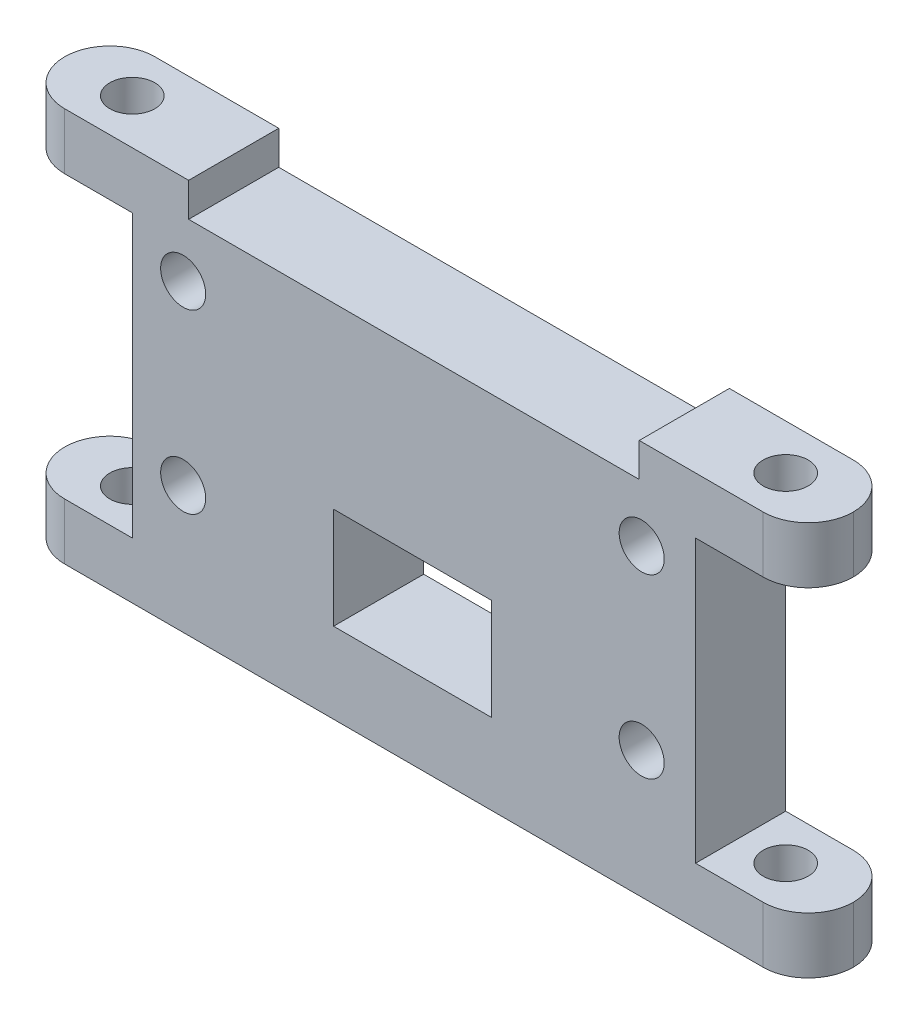
ISO-10303-21;
HEADER;
FILE_DESCRIPTION(('STEP AP214'),'2;1');
FILE_NAME('part.step','',(''),(''),'','','');
FILE_SCHEMA(('AUTOMOTIVE_DESIGN { 1 0 10303 214 1 1 1 1 }'));
ENDSEC;
DATA;
#1=APPLICATION_CONTEXT('core data for automotive mechanical design processes');
#2=APPLICATION_PROTOCOL_DEFINITION('international standard','automotive_design',2000,#1);
#3=PRODUCT_CONTEXT('',#1,'mechanical');
#4=PRODUCT('Part','Part','',(#3));
#5=PRODUCT_RELATED_PRODUCT_CATEGORY('part','',(#4));
#6=PRODUCT_DEFINITION_FORMATION('','',#4);
#7=PRODUCT_DEFINITION_CONTEXT('part definition',#1,'design');
#8=PRODUCT_DEFINITION('design','',#6,#7);
#9=PRODUCT_DEFINITION_SHAPE('','',#8);
#10=(LENGTH_UNIT() NAMED_UNIT(*) SI_UNIT(.MILLI.,.METRE.));
#11=(NAMED_UNIT(*) PLANE_ANGLE_UNIT() SI_UNIT($,.RADIAN.));
#12=(NAMED_UNIT(*) SI_UNIT($,.STERADIAN.) SOLID_ANGLE_UNIT());
#13=UNCERTAINTY_MEASURE_WITH_UNIT(LENGTH_MEASURE(1.E-05),#10,'distance_accuracy_value','');
#14=(GEOMETRIC_REPRESENTATION_CONTEXT(3) GLOBAL_UNCERTAINTY_ASSIGNED_CONTEXT((#13)) GLOBAL_UNIT_ASSIGNED_CONTEXT((#10,
#11,#12)) REPRESENTATION_CONTEXT('',''));
#15=CARTESIAN_POINT('',(0.,0.,0.));
#16=DIRECTION('',(0.,0.,1.));
#17=DIRECTION('',(1.,0.,0.));
#18=AXIS2_PLACEMENT_3D('',#15,#16,#17);
#19=CARTESIAN_POINT('',(40.2792570677186,0.,4.));
#20=DIRECTION('',(0.,-1.,0.));
#21=DIRECTION('',(0.,0.,-1.));
#22=AXIS2_PLACEMENT_3D('',#19,#20,#21);
#23=CYLINDRICAL_SURFACE('',#22,4.);
#24=CARTESIAN_POINT('',(40.2792570677186,-10.5128205128205,4.));
#25=DIRECTION('',(0.,-1.,0.));
#26=DIRECTION('',(1.,0.,0.));
#27=AXIS2_PLACEMENT_3D('',#24,#25,#26);
#28=CIRCLE('',#27,4.);
#29=CARTESIAN_POINT('',(40.2792570677186,-10.5128205128205,8.));
#30=VERTEX_POINT('',#29);
#31=CARTESIAN_POINT('',(44.2792570677186,-10.5128205128205,4.));
#32=VERTEX_POINT('',#31);
#33=EDGE_CURVE('E233',#30,#32,#28,.F.);
#34=ORIENTED_EDGE('',*,*,#33,.F.);
#35=DIRECTION('',(0.,1.,0.));
#36=VECTOR('',#35,1.);
#37=CARTESIAN_POINT('',(40.2792570677186,19.4871794871795,8.));
#38=LINE('',#37,#36);
#39=CARTESIAN_POINT('',(40.2792570677186,-15.5128205128205,8.));
#40=VERTEX_POINT('',#39);
#41=EDGE_CURVE('E11',#40,#30,#38,.T.);
#42=ORIENTED_EDGE('',*,*,#41,.F.);
#43=CARTESIAN_POINT('',(40.2792570677186,-15.5128205128205,4.));
#44=DIRECTION('',(0.,1.,0.));
#45=DIRECTION('',(-1.,0.,0.));
#46=AXIS2_PLACEMENT_3D('',#43,#44,#45);
#47=CIRCLE('',#46,4.);
#48=CARTESIAN_POINT('',(44.2792570677186,-15.5128205128205,4.));
#49=VERTEX_POINT('',#48);
#50=EDGE_CURVE('E396',#49,#40,#47,.F.);
#51=ORIENTED_EDGE('',*,*,#50,.F.);
#52=DIRECTION('',(0.,1.,0.));
#53=VECTOR('',#52,1.);
#54=CARTESIAN_POINT('',(44.2792570677186,-15.5128205128205,4.));
#55=LINE('',#54,#53);
#56=EDGE_CURVE('E407',#32,#49,#55,.F.);
#57=ORIENTED_EDGE('',*,*,#56,.F.);
#58=EDGE_LOOP('',(#34,#42,#51,#57));
#59=FACE_BOUND('',#58,.T.);
#60=ADVANCED_FACE('F33',(#59),#23,.T.);
#61=CARTESIAN_POINT('',(40.2792570677186,19.4871794871795,4.));
#62=DIRECTION('',(0.,1.,0.));
#63=DIRECTION('',(0.,0.,1.));
#64=AXIS2_PLACEMENT_3D('',#61,#62,#63);
#65=CYLINDRICAL_SURFACE('',#64,4.);
#66=CARTESIAN_POINT('',(40.2792570677186,-10.5128205128205,4.));
#67=DIRECTION('',(0.,-1.,0.));
#68=DIRECTION('',(1.,0.,0.));
#69=AXIS2_PLACEMENT_3D('',#66,#67,#68);
#70=CIRCLE('',#69,4.);
#71=CARTESIAN_POINT('',(40.2792570677186,-10.5128205128205,0.));
#72=VERTEX_POINT('',#71);
#73=EDGE_CURVE('E231',#32,#72,#70,.F.);
#74=ORIENTED_EDGE('',*,*,#73,.F.);
#75=ORIENTED_EDGE('',*,*,#56,.T.);
#76=CARTESIAN_POINT('',(40.2792570677186,-15.5128205128205,4.));
#77=DIRECTION('',(0.,1.,0.));
#78=DIRECTION('',(-1.,0.,0.));
#79=AXIS2_PLACEMENT_3D('',#76,#77,#78);
#80=CIRCLE('',#79,4.);
#81=CARTESIAN_POINT('',(40.2792570677186,-15.5128205128205,0.));
#82=VERTEX_POINT('',#81);
#83=EDGE_CURVE('E398',#82,#49,#80,.F.);
#84=ORIENTED_EDGE('',*,*,#83,.F.);
#85=DIRECTION('',(0.,1.,0.));
#86=VECTOR('',#85,1.);
#87=CARTESIAN_POINT('',(40.2792570677186,0.,0.));
#88=LINE('',#87,#86);
#89=EDGE_CURVE('E388',#72,#82,#88,.F.);
#90=ORIENTED_EDGE('',*,*,#89,.F.);
#91=EDGE_LOOP('',(#74,#75,#84,#90));
#92=FACE_BOUND('',#91,.T.);
#93=ADVANCED_FACE('F431',(#92),#65,.T.);
#94=CARTESIAN_POINT('',(38.2792570677186,19.4871794871795,4.));
#95=DIRECTION('',(0.,-1.,0.));
#96=DIRECTION('',(1.,0.,0.));
#97=AXIS2_PLACEMENT_3D('',#94,#95,#96);
#98=CYLINDRICAL_SURFACE('',#97,2.00000000000001);
#99=CARTESIAN_POINT('',(38.2792570677186,-10.5128205128205,4.));
#100=DIRECTION('',(0.,-1.,0.));
#101=DIRECTION('',(1.,0.,0.));
#102=AXIS2_PLACEMENT_3D('',#99,#100,#101);
#103=CIRCLE('',#102,2.00000000000001);
#104=CARTESIAN_POINT('',(40.2792570677186,-10.5128205128205,4.));
#105=VERTEX_POINT('',#104);
#106=EDGE_CURVE('E37',#105,#105,#103,.F.);
#107=ORIENTED_EDGE('',*,*,#106,.T.);
#108=EDGE_LOOP('',(#107));
#109=FACE_BOUND('',#108,.T.);
#110=CARTESIAN_POINT('',(38.2792570677186,-15.5128205128205,4.));
#111=DIRECTION('',(0.,-1.,0.));
#112=DIRECTION('',(1.,0.,0.));
#113=AXIS2_PLACEMENT_3D('',#110,#111,#112);
#114=CIRCLE('',#113,2.00000000000001);
#115=CARTESIAN_POINT('',(40.2792570677186,-15.5128205128205,4.));
#116=VERTEX_POINT('',#115);
#117=EDGE_CURVE('E350',#116,#116,#114,.T.);
#118=ORIENTED_EDGE('',*,*,#117,.T.);
#119=EDGE_LOOP('',(#118));
#120=FACE_BOUND('',#119,.T.);
#121=ADVANCED_FACE('F438',(#109,#120),#98,.F.);
#122=CARTESIAN_POINT('',(-21.7207429322814,0.,4.));
#123=DIRECTION('',(0.,1.,0.));
#124=DIRECTION('',(0.,0.,1.));
#125=AXIS2_PLACEMENT_3D('',#122,#123,#124);
#126=CYLINDRICAL_SURFACE('',#125,4.);
#127=CARTESIAN_POINT('',(-21.7207429322814,14.4871794871795,4.));
#128=DIRECTION('',(0.,1.,0.));
#129=DIRECTION('',(0.,0.,1.));
#130=AXIS2_PLACEMENT_3D('',#127,#128,#129);
#131=CIRCLE('',#130,4.);
#132=CARTESIAN_POINT('',(-21.7207429322814,14.4871794871795,8.));
#133=VERTEX_POINT('',#132);
#134=CARTESIAN_POINT('',(-25.7207429322814,14.4871794871795,4.));
#135=VERTEX_POINT('',#134);
#136=EDGE_CURVE('E263',#133,#135,#131,.F.);
#137=ORIENTED_EDGE('',*,*,#136,.F.);
#138=DIRECTION('',(0.,-1.,0.));
#139=VECTOR('',#138,1.);
#140=CARTESIAN_POINT('',(-21.7207429322814,-15.5128205128205,8.));
#141=LINE('',#140,#139);
#142=CARTESIAN_POINT('',(-21.7207429322814,19.4871794871795,8.));
#143=VERTEX_POINT('',#142);
#144=EDGE_CURVE('E402',#143,#133,#141,.T.);
#145=ORIENTED_EDGE('',*,*,#144,.F.);
#146=CARTESIAN_POINT('',(-21.7207429322814,19.4871794871795,4.));
#147=DIRECTION('',(0.,-1.,0.));
#148=DIRECTION('',(0.,0.,-1.));
#149=AXIS2_PLACEMENT_3D('',#146,#147,#148);
#150=CIRCLE('',#149,4.);
#151=CARTESIAN_POINT('',(-25.7207429322814,19.4871794871795,4.));
#152=VERTEX_POINT('',#151);
#153=EDGE_CURVE('E367',#152,#143,#150,.F.);
#154=ORIENTED_EDGE('',*,*,#153,.F.);
#155=DIRECTION('',(0.,-1.,0.));
#156=VECTOR('',#155,1.);
#157=CARTESIAN_POINT('',(-25.7207429322814,19.4871794871795,4.));
#158=LINE('',#157,#156);
#159=EDGE_CURVE('E356',#135,#152,#158,.F.);
#160=ORIENTED_EDGE('',*,*,#159,.F.);
#161=EDGE_LOOP('',(#137,#145,#154,#160));
#162=FACE_BOUND('',#161,.T.);
#163=ADVANCED_FACE('F492',(#162),#126,.T.);
#164=CARTESIAN_POINT('',(-21.7207429322814,19.4871794871795,4.));
#165=DIRECTION('',(0.,-1.,0.));
#166=DIRECTION('',(0.,0.,-1.));
#167=AXIS2_PLACEMENT_3D('',#164,#165,#166);
#168=CYLINDRICAL_SURFACE('',#167,4.);
#169=CARTESIAN_POINT('',(-21.7207429322814,14.4871794871795,4.));
#170=DIRECTION('',(0.,1.,0.));
#171=DIRECTION('',(0.,0.,1.));
#172=AXIS2_PLACEMENT_3D('',#169,#170,#171);
#173=CIRCLE('',#172,4.);
#174=CARTESIAN_POINT('',(-21.7207429322814,14.4871794871795,0.));
#175=VERTEX_POINT('',#174);
#176=EDGE_CURVE('E261',#135,#175,#173,.F.);
#177=ORIENTED_EDGE('',*,*,#176,.F.);
#178=ORIENTED_EDGE('',*,*,#159,.T.);
#179=CARTESIAN_POINT('',(-21.7207429322814,19.4871794871795,4.));
#180=DIRECTION('',(0.,-1.,0.));
#181=DIRECTION('',(0.,0.,-1.));
#182=AXIS2_PLACEMENT_3D('',#179,#180,#181);
#183=CIRCLE('',#182,4.);
#184=CARTESIAN_POINT('',(-21.7207429322814,19.4871794871795,0.));
#185=VERTEX_POINT('',#184);
#186=EDGE_CURVE('E377',#185,#152,#183,.F.);
#187=ORIENTED_EDGE('',*,*,#186,.F.);
#188=DIRECTION('',(0.,-1.,0.));
#189=VECTOR('',#188,1.);
#190=CARTESIAN_POINT('',(-21.7207429322814,0.,0.));
#191=LINE('',#190,#189);
#192=EDGE_CURVE('E384',#175,#185,#191,.F.);
#193=ORIENTED_EDGE('',*,*,#192,.F.);
#194=EDGE_LOOP('',(#177,#178,#187,#193));
#195=FACE_BOUND('',#194,.T.);
#196=ADVANCED_FACE('F486',(#195),#168,.T.);
#197=CARTESIAN_POINT('',(-19.7207429322814,19.4871794871795,4.));
#198=DIRECTION('',(0.,-1.,0.));
#199=DIRECTION('',(1.,0.,0.));
#200=AXIS2_PLACEMENT_3D('',#197,#198,#199);
#201=CYLINDRICAL_SURFACE('',#200,2.);
#202=CARTESIAN_POINT('',(-19.7207429322814,14.4871794871795,4.));
#203=DIRECTION('',(0.,1.,0.));
#204=DIRECTION('',(0.,0.,1.));
#205=AXIS2_PLACEMENT_3D('',#202,#203,#204);
#206=CIRCLE('',#205,2.);
#207=CARTESIAN_POINT('',(-19.7207429322814,14.4871794871795,6.));
#208=VERTEX_POINT('',#207);
#209=EDGE_CURVE('E260',#208,#208,#206,.F.);
#210=ORIENTED_EDGE('',*,*,#209,.T.);
#211=EDGE_LOOP('',(#210));
#212=FACE_BOUND('',#211,.T.);
#213=CARTESIAN_POINT('',(-19.7207429322814,19.4871794871795,4.));
#214=DIRECTION('',(0.,-1.,0.));
#215=DIRECTION('',(1.,0.,0.));
#216=AXIS2_PLACEMENT_3D('',#213,#214,#215);
#217=CIRCLE('',#216,2.);
#218=CARTESIAN_POINT('',(-17.7207429322814,19.4871794871795,4.));
#219=VERTEX_POINT('',#218);
#220=EDGE_CURVE('E347',#219,#219,#217,.T.);
#221=ORIENTED_EDGE('',*,*,#220,.F.);
#222=EDGE_LOOP('',(#221));
#223=FACE_BOUND('',#222,.T.);
#224=ADVANCED_FACE('F530',(#212,#223),#201,.F.);
#225=CARTESIAN_POINT('',(-25.7207429322814,19.4871794871795,8.));
#226=DIRECTION('',(0.,-1.,0.));
#227=DIRECTION('',(0.,0.,-1.));
#228=AXIS2_PLACEMENT_3D('',#225,#226,#227);
#229=PLANE('',#228);
#230=CARTESIAN_POINT('',(38.2792570677186,19.4871794871795,4.));
#231=DIRECTION('',(0.,-1.,0.));
#232=DIRECTION('',(1.,0.,0.));
#233=AXIS2_PLACEMENT_3D('',#230,#231,#232);
#234=CIRCLE('',#233,2.00000000000001);
#235=CARTESIAN_POINT('',(40.2792570677186,19.4871794871795,4.));
#236=VERTEX_POINT('',#235);
#237=EDGE_CURVE('E353',#236,#236,#234,.T.);
#238=ORIENTED_EDGE('',*,*,#237,.T.);
#239=EDGE_LOOP('',(#238));
#240=FACE_BOUND('',#239,.T.);
#241=DIRECTION('',(-1.,0.,0.));
#242=VECTOR('',#241,1.);
#243=CARTESIAN_POINT('',(-25.7207429322814,19.4871794871795,0.));
#244=LINE('',#243,#242);
#245=CARTESIAN_POINT('',(40.2792570677186,19.4871794871795,0.));
#246=VERTEX_POINT('',#245);
#247=CARTESIAN_POINT('',(29.2792570677186,19.4871794871795,0.));
#248=VERTEX_POINT('',#247);
#249=EDGE_CURVE('E363',#246,#248,#244,.T.);
#250=ORIENTED_EDGE('',*,*,#249,.T.);
#251=DIRECTION('',(0.,0.,-1.));
#252=VECTOR('',#251,1.);
#253=CARTESIAN_POINT('',(29.2792570677186,19.4871794871795,0.));
#254=LINE('',#253,#252);
#255=CARTESIAN_POINT('',(29.2792570677186,19.4871794871795,8.));
#256=VERTEX_POINT('',#255);
#257=EDGE_CURVE('E265',#256,#248,#254,.T.);
#258=ORIENTED_EDGE('',*,*,#257,.F.);
#259=DIRECTION('',(-1.,0.,0.));
#260=VECTOR('',#259,1.);
#261=CARTESIAN_POINT('',(-25.7207429322814,19.4871794871795,8.));
#262=LINE('',#261,#260);
#263=CARTESIAN_POINT('',(40.2792570677186,19.4871794871795,8.));
#264=VERTEX_POINT('',#263);
#265=EDGE_CURVE('E364',#264,#256,#262,.T.);
#266=ORIENTED_EDGE('',*,*,#265,.F.);
#267=CARTESIAN_POINT('',(40.2792570677186,19.4871794871795,4.));
#268=DIRECTION('',(0.,-1.,0.));
#269=DIRECTION('',(0.,0.,-1.));
#270=AXIS2_PLACEMENT_3D('',#267,#268,#269);
#271=CIRCLE('',#270,4.);
#272=CARTESIAN_POINT('',(44.2792570677186,19.4871794871795,4.));
#273=VERTEX_POINT('',#272);
#274=EDGE_CURVE('E380',#264,#273,#271,.F.);
#275=ORIENTED_EDGE('',*,*,#274,.T.);
#276=CARTESIAN_POINT('',(40.2792570677186,19.4871794871795,4.));
#277=DIRECTION('',(0.,-1.,0.));
#278=DIRECTION('',(0.,0.,-1.));
#279=AXIS2_PLACEMENT_3D('',#276,#277,#278);
#280=CIRCLE('',#279,4.);
#281=EDGE_CURVE('E382',#273,#246,#280,.F.);
#282=ORIENTED_EDGE('',*,*,#281,.T.);
#283=EDGE_LOOP('',(#250,#258,#266,#275,#282));
#284=FACE_BOUND('',#283,.T.);
#285=ADVANCED_FACE('F459',(#240,#284),#229,.F.);
#286=CARTESIAN_POINT('',(-25.7207429322814,-15.5128205128205,8.));
#287=DIRECTION('',(0.,1.,0.));
#288=DIRECTION('',(-1.,0.,0.));
#289=AXIS2_PLACEMENT_3D('',#286,#287,#288);
#290=PLANE('',#289);
#291=CARTESIAN_POINT('',(-19.7207429322814,-15.5128205128205,4.));
#292=DIRECTION('',(0.,-1.,0.));
#293=DIRECTION('',(1.,0.,0.));
#294=AXIS2_PLACEMENT_3D('',#291,#292,#293);
#295=CIRCLE('',#294,2.);
#296=CARTESIAN_POINT('',(-17.7207429322814,-15.5128205128205,4.));
#297=VERTEX_POINT('',#296);
#298=EDGE_CURVE('E340',#297,#297,#295,.T.);
#299=ORIENTED_EDGE('',*,*,#298,.F.);
#300=EDGE_LOOP('',(#299));
#301=FACE_BOUND('',#300,.T.);
#302=ORIENTED_EDGE('',*,*,#117,.F.);
#303=EDGE_LOOP('',(#302));
#304=FACE_BOUND('',#303,.T.);
#305=DIRECTION('',(1.,0.,0.));
#306=VECTOR('',#305,1.);
#307=CARTESIAN_POINT('',(-25.7207429322814,-15.5128205128205,0.));
#308=LINE('',#307,#306);
#309=CARTESIAN_POINT('',(-21.7207429322814,-15.5128205128205,0.));
#310=VERTEX_POINT('',#309);
#311=EDGE_CURVE('E368',#310,#82,#308,.T.);
#312=ORIENTED_EDGE('',*,*,#311,.T.);
#313=ORIENTED_EDGE('',*,*,#83,.T.);
#314=ORIENTED_EDGE('',*,*,#50,.T.);
#315=DIRECTION('',(1.,0.,0.));
#316=VECTOR('',#315,1.);
#317=CARTESIAN_POINT('',(-25.7207429322814,-15.5128205128205,8.));
#318=LINE('',#317,#316);
#319=CARTESIAN_POINT('',(-21.7207429322814,-15.5128205128205,8.));
#320=VERTEX_POINT('',#319);
#321=EDGE_CURVE('E359',#320,#40,#318,.T.);
#322=ORIENTED_EDGE('',*,*,#321,.F.);
#323=CARTESIAN_POINT('',(-21.7207429322814,-15.5128205128205,4.));
#324=DIRECTION('',(0.,1.,0.));
#325=DIRECTION('',(-1.,0.,0.));
#326=AXIS2_PLACEMENT_3D('',#323,#324,#325);
#327=CIRCLE('',#326,4.);
#328=CARTESIAN_POINT('',(-25.7207429322814,-15.5128205128205,4.));
#329=VERTEX_POINT('',#328);
#330=EDGE_CURVE('E392',#320,#329,#327,.F.);
#331=ORIENTED_EDGE('',*,*,#330,.T.);
#332=CARTESIAN_POINT('',(-21.7207429322814,-15.5128205128205,4.));
#333=DIRECTION('',(0.,1.,0.));
#334=DIRECTION('',(-1.,0.,0.));
#335=AXIS2_PLACEMENT_3D('',#332,#333,#334);
#336=CIRCLE('',#335,4.);
#337=EDGE_CURVE('E394',#329,#310,#336,.F.);
#338=ORIENTED_EDGE('',*,*,#337,.T.);
#339=EDGE_LOOP('',(#312,#313,#314,#322,#331,#338));
#340=FACE_BOUND('',#339,.T.);
#341=ADVANCED_FACE('F509',(#301,#304,#340),#290,.F.);
#342=ORIENTED_EDGE('',*,*,#220,.T.);
#343=EDGE_LOOP('',(#342));
#344=FACE_BOUND('',#343,.T.);
#345=CARTESIAN_POINT('',(-10.7207429322814,19.4871794871795,8.));
#346=VERTEX_POINT('',#345);
#347=EDGE_CURVE('E362',#346,#143,#262,.T.);
#348=ORIENTED_EDGE('',*,*,#347,.F.);
#349=DIRECTION('',(0.,0.,1.));
#350=VECTOR('',#349,1.);
#351=CARTESIAN_POINT('',(-10.7207429322814,19.4871794871795,0.));
#352=LINE('',#351,#350);
#353=CARTESIAN_POINT('',(-10.7207429322814,19.4871794871795,0.));
#354=VERTEX_POINT('',#353);
#355=EDGE_CURVE('E269',#354,#346,#352,.T.);
#356=ORIENTED_EDGE('',*,*,#355,.F.);
#357=EDGE_CURVE('E371',#354,#185,#244,.T.);
#358=ORIENTED_EDGE('',*,*,#357,.T.);
#359=ORIENTED_EDGE('',*,*,#186,.T.);
#360=ORIENTED_EDGE('',*,*,#153,.T.);
#361=EDGE_LOOP('',(#348,#356,#358,#359,#360));
#362=FACE_BOUND('',#361,.T.);
#363=ADVANCED_FACE('F479',(#344,#362),#229,.F.);
#364=CARTESIAN_POINT('',(0.,0.,8.));
#365=DIRECTION('',(0.,0.,1.));
#366=DIRECTION('',(1.,0.,0.));
#367=AXIS2_PLACEMENT_3D('',#364,#365,#366);
#368=PLANE('',#367);
#369=DIRECTION('',(-1.,0.,0.));
#370=VECTOR('',#369,1.);
#371=CARTESIAN_POINT('',(34.2792570677186,-10.5128205128205,8.));
#372=LINE('',#371,#370);
#373=CARTESIAN_POINT('',(34.2792570677186,-10.5128205128205,8.));
#374=VERTEX_POINT('',#373);
#375=EDGE_CURVE('E206',#30,#374,#372,.T.);
#376=ORIENTED_EDGE('',*,*,#375,.T.);
#377=DIRECTION('',(0.,1.,0.));
#378=VECTOR('',#377,1.);
#379=CARTESIAN_POINT('',(34.2792570677186,14.4871794871795,8.));
#380=LINE('',#379,#378);
#381=CARTESIAN_POINT('',(34.2792570677186,14.4871794871795,8.));
#382=VERTEX_POINT('',#381);
#383=EDGE_CURVE('E201',#374,#382,#380,.T.);
#384=ORIENTED_EDGE('',*,*,#383,.T.);
#385=DIRECTION('',(1.,0.,0.));
#386=VECTOR('',#385,1.);
#387=CARTESIAN_POINT('',(34.2792570677186,14.4871794871795,8.));
#388=LINE('',#387,#386);
#389=CARTESIAN_POINT('',(40.2792570677186,14.4871794871795,8.));
#390=VERTEX_POINT('',#389);
#391=EDGE_CURVE('E209',#382,#390,#388,.T.);
#392=ORIENTED_EDGE('',*,*,#391,.T.);
#393=EDGE_CURVE('E42',#390,#264,#38,.T.);
#394=ORIENTED_EDGE('',*,*,#393,.T.);
#395=ORIENTED_EDGE('',*,*,#265,.T.);
#396=DIRECTION('',(0.,1.,0.));
#397=VECTOR('',#396,1.);
#398=CARTESIAN_POINT('',(29.2792570677186,16.4871794871795,8.));
#399=LINE('',#398,#397);
#400=CARTESIAN_POINT('',(29.2792570677186,16.4871794871795,8.));
#401=VERTEX_POINT('',#400);
#402=EDGE_CURVE('E281',#401,#256,#399,.T.);
#403=ORIENTED_EDGE('',*,*,#402,.F.);
#404=DIRECTION('',(1.,0.,0.));
#405=VECTOR('',#404,1.);
#406=CARTESIAN_POINT('',(29.2792570677186,16.4871794871795,8.));
#407=LINE('',#406,#405);
#408=CARTESIAN_POINT('',(-10.7207429322814,16.4871794871795,8.));
#409=VERTEX_POINT('',#408);
#410=EDGE_CURVE('E275',#409,#401,#407,.T.);
#411=ORIENTED_EDGE('',*,*,#410,.F.);
#412=DIRECTION('',(0.,1.,0.));
#413=VECTOR('',#412,1.);
#414=CARTESIAN_POINT('',(-10.7207429322814,16.4871794871795,8.));
#415=LINE('',#414,#413);
#416=EDGE_CURVE('E284',#409,#346,#415,.T.);
#417=ORIENTED_EDGE('',*,*,#416,.T.);
#418=ORIENTED_EDGE('',*,*,#347,.T.);
#419=ORIENTED_EDGE('',*,*,#144,.T.);
#420=DIRECTION('',(1.,0.,0.));
#421=VECTOR('',#420,1.);
#422=CARTESIAN_POINT('',(-15.7207429322814,14.4871794871795,8.));
#423=LINE('',#422,#421);
#424=CARTESIAN_POINT('',(-15.7207429322814,14.4871794871795,8.));
#425=VERTEX_POINT('',#424);
#426=EDGE_CURVE('E243',#133,#425,#423,.T.);
#427=ORIENTED_EDGE('',*,*,#426,.T.);
#428=DIRECTION('',(0.,-1.,0.));
#429=VECTOR('',#428,1.);
#430=CARTESIAN_POINT('',(-15.7207429322814,14.4871794871795,8.));
#431=LINE('',#430,#429);
#432=CARTESIAN_POINT('',(-15.7207429322814,-10.5128205128205,8.));
#433=VERTEX_POINT('',#432);
#434=EDGE_CURVE('E236',#425,#433,#431,.T.);
#435=ORIENTED_EDGE('',*,*,#434,.T.);
#436=DIRECTION('',(-1.,0.,0.));
#437=VECTOR('',#436,1.);
#438=CARTESIAN_POINT('',(-15.7207429322814,-10.5128205128205,8.));
#439=LINE('',#438,#437);
#440=CARTESIAN_POINT('',(-21.7207429322814,-10.5128205128205,8.));
#441=VERTEX_POINT('',#440);
#442=EDGE_CURVE('E239',#433,#441,#439,.T.);
#443=ORIENTED_EDGE('',*,*,#442,.T.);
#444=EDGE_CURVE('E401',#441,#320,#141,.T.);
#445=ORIENTED_EDGE('',*,*,#444,.T.);
#446=ORIENTED_EDGE('',*,*,#321,.T.);
#447=ORIENTED_EDGE('',*,*,#41,.T.);
#448=EDGE_LOOP('',(#376,#384,#392,#394,#395,#403,#411,#417,#418,#419,#427,#435,#443,#445,#446,#447));
#449=FACE_BOUND('',#448,.T.);
#450=CARTESIAN_POINT('',(-11.2057429322814,-4.21282051282052,8.));
#451=DIRECTION('',(0.,0.,-1.));
#452=DIRECTION('',(-1.,0.,0.));
#453=AXIS2_PLACEMENT_3D('',#450,#451,#452);
#454=CIRCLE('',#453,2.);
#455=CARTESIAN_POINT('',(-13.2057429322814,-4.21282051282052,8.));
#456=VERTEX_POINT('',#455);
#457=EDGE_CURVE('E291',#456,#456,#454,.T.);
#458=ORIENTED_EDGE('',*,*,#457,.T.);
#459=EDGE_LOOP('',(#458));
#460=FACE_BOUND('',#459,.T.);
#461=CARTESIAN_POINT('',(-11.2057429322814,11.4871794871795,8.));
#462=DIRECTION('',(0.,0.,-1.));
#463=DIRECTION('',(-1.,0.,0.));
#464=AXIS2_PLACEMENT_3D('',#461,#462,#463);
#465=CIRCLE('',#464,2.);
#466=CARTESIAN_POINT('',(-13.2057429322814,11.4871794871795,8.));
#467=VERTEX_POINT('',#466);
#468=EDGE_CURVE('E297',#467,#467,#465,.T.);
#469=ORIENTED_EDGE('',*,*,#468,.T.);
#470=EDGE_LOOP('',(#469));
#471=FACE_BOUND('',#470,.T.);
#472=CARTESIAN_POINT('',(29.4942570677186,11.4871794871795,8.));
#473=DIRECTION('',(0.,0.,-1.));
#474=DIRECTION('',(-1.,0.,0.));
#475=AXIS2_PLACEMENT_3D('',#472,#473,#474);
#476=CIRCLE('',#475,2.);
#477=CARTESIAN_POINT('',(27.4942570677186,11.4871794871795,8.));
#478=VERTEX_POINT('',#477);
#479=EDGE_CURVE('E303',#478,#478,#476,.T.);
#480=ORIENTED_EDGE('',*,*,#479,.T.);
#481=EDGE_LOOP('',(#480));
#482=FACE_BOUND('',#481,.T.);
#483=CARTESIAN_POINT('',(29.4942570677186,-4.21282051282052,8.));
#484=DIRECTION('',(0.,0.,-1.));
#485=DIRECTION('',(-1.,0.,0.));
#486=AXIS2_PLACEMENT_3D('',#483,#484,#485);
#487=CIRCLE('',#486,2.);
#488=CARTESIAN_POINT('',(27.4942570677186,-4.21282051282052,8.));
#489=VERTEX_POINT('',#488);
#490=EDGE_CURVE('E309',#489,#489,#487,.T.);
#491=ORIENTED_EDGE('',*,*,#490,.T.);
#492=EDGE_LOOP('',(#491));
#493=FACE_BOUND('',#492,.T.);
#494=DIRECTION('',(0.,1.,0.));
#495=VECTOR('',#494,1.);
#496=CARTESIAN_POINT('',(2.14425706771847,-8.36282051282048,8.));
#497=LINE('',#496,#495);
#498=CARTESIAN_POINT('',(2.14425706771847,-8.36282051282048,8.));
#499=VERTEX_POINT('',#498);
#500=CARTESIAN_POINT('',(2.14425706771847,0.637179487179518,8.));
#501=VERTEX_POINT('',#500);
#502=EDGE_CURVE('E315',#499,#501,#497,.T.);
#503=ORIENTED_EDGE('',*,*,#502,.T.);
#504=DIRECTION('',(1.,0.,0.));
#505=VECTOR('',#504,1.);
#506=CARTESIAN_POINT('',(2.14425706771847,0.637179487179518,8.));
#507=LINE('',#506,#505);
#508=CARTESIAN_POINT('',(16.1442570677185,0.637179487179515,8.));
#509=VERTEX_POINT('',#508);
#510=EDGE_CURVE('E318',#501,#509,#507,.T.);
#511=ORIENTED_EDGE('',*,*,#510,.T.);
#512=DIRECTION('',(0.,-1.,0.));
#513=VECTOR('',#512,1.);
#514=CARTESIAN_POINT('',(16.1442570677185,-8.36282051282048,8.));
#515=LINE('',#514,#513);
#516=CARTESIAN_POINT('',(16.1442570677185,-8.36282051282048,8.));
#517=VERTEX_POINT('',#516);
#518=EDGE_CURVE('E322',#509,#517,#515,.T.);
#519=ORIENTED_EDGE('',*,*,#518,.T.);
#520=DIRECTION('',(-1.,0.,0.));
#521=VECTOR('',#520,1.);
#522=CARTESIAN_POINT('',(2.14425706771847,-8.36282051282048,8.));
#523=LINE('',#522,#521);
#524=EDGE_CURVE('E325',#517,#499,#523,.T.);
#525=ORIENTED_EDGE('',*,*,#524,.T.);
#526=EDGE_LOOP('',(#503,#511,#519,#525));
#527=FACE_BOUND('',#526,.T.);
#528=ADVANCED_FACE('F217',(#449,#460,#471,#482,#493,#527),#368,.T.);
#529=CARTESIAN_POINT('',(0.,0.,0.));
#530=DIRECTION('',(0.,0.,1.));
#531=DIRECTION('',(1.,0.,0.));
#532=AXIS2_PLACEMENT_3D('',#529,#530,#531);
#533=PLANE('',#532);
#534=CARTESIAN_POINT('',(-11.2057429322814,-4.21282051282052,0.));
#535=DIRECTION('',(0.,0.,-1.));
#536=DIRECTION('',(-1.,0.,0.));
#537=AXIS2_PLACEMENT_3D('',#534,#535,#536);
#538=CIRCLE('',#537,2.);
#539=CARTESIAN_POINT('',(-13.2057429322814,-4.21282051282052,0.));
#540=VERTEX_POINT('',#539);
#541=EDGE_CURVE('E283',#540,#540,#538,.T.);
#542=ORIENTED_EDGE('',*,*,#541,.F.);
#543=EDGE_LOOP('',(#542));
#544=FACE_BOUND('',#543,.T.);
#545=CARTESIAN_POINT('',(-11.2057429322814,11.4871794871795,0.));
#546=DIRECTION('',(0.,0.,-1.));
#547=DIRECTION('',(-1.,0.,0.));
#548=AXIS2_PLACEMENT_3D('',#545,#546,#547);
#549=CIRCLE('',#548,2.);
#550=CARTESIAN_POINT('',(-13.2057429322814,11.4871794871795,0.));
#551=VERTEX_POINT('',#550);
#552=EDGE_CURVE('E294',#551,#551,#549,.T.);
#553=ORIENTED_EDGE('',*,*,#552,.F.);
#554=EDGE_LOOP('',(#553));
#555=FACE_BOUND('',#554,.T.);
#556=CARTESIAN_POINT('',(29.4942570677186,11.4871794871795,0.));
#557=DIRECTION('',(0.,0.,-1.));
#558=DIRECTION('',(-1.,0.,0.));
#559=AXIS2_PLACEMENT_3D('',#556,#557,#558);
#560=CIRCLE('',#559,2.);
#561=CARTESIAN_POINT('',(27.4942570677186,11.4871794871795,0.));
#562=VERTEX_POINT('',#561);
#563=EDGE_CURVE('E300',#562,#562,#560,.T.);
#564=ORIENTED_EDGE('',*,*,#563,.F.);
#565=EDGE_LOOP('',(#564));
#566=FACE_BOUND('',#565,.T.);
#567=CARTESIAN_POINT('',(29.4942570677186,-4.21282051282052,0.));
#568=DIRECTION('',(0.,0.,-1.));
#569=DIRECTION('',(-1.,0.,0.));
#570=AXIS2_PLACEMENT_3D('',#567,#568,#569);
#571=CIRCLE('',#570,2.);
#572=CARTESIAN_POINT('',(27.4942570677186,-4.21282051282052,0.));
#573=VERTEX_POINT('',#572);
#574=EDGE_CURVE('E306',#573,#573,#571,.T.);
#575=ORIENTED_EDGE('',*,*,#574,.F.);
#576=EDGE_LOOP('',(#575));
#577=FACE_BOUND('',#576,.T.);
#578=DIRECTION('',(1.,0.,0.));
#579=VECTOR('',#578,1.);
#580=CARTESIAN_POINT('',(2.14425706771847,0.637179487179518,0.));
#581=LINE('',#580,#579);
#582=CARTESIAN_POINT('',(2.14425706771847,0.637179487179518,0.));
#583=VERTEX_POINT('',#582);
#584=CARTESIAN_POINT('',(16.1442570677185,0.637179487179515,0.));
#585=VERTEX_POINT('',#584);
#586=EDGE_CURVE('E330',#583,#585,#581,.T.);
#587=ORIENTED_EDGE('',*,*,#586,.F.);
#588=DIRECTION('',(0.,1.,0.));
#589=VECTOR('',#588,1.);
#590=CARTESIAN_POINT('',(2.14425706771847,-8.36282051282048,0.));
#591=LINE('',#590,#589);
#592=CARTESIAN_POINT('',(2.14425706771847,-8.36282051282048,0.));
#593=VERTEX_POINT('',#592);
#594=EDGE_CURVE('E312',#593,#583,#591,.T.);
#595=ORIENTED_EDGE('',*,*,#594,.F.);
#596=DIRECTION('',(-1.,0.,0.));
#597=VECTOR('',#596,1.);
#598=CARTESIAN_POINT('',(2.14425706771847,-8.36282051282048,0.));
#599=LINE('',#598,#597);
#600=CARTESIAN_POINT('',(16.1442570677185,-8.36282051282048,0.));
#601=VERTEX_POINT('',#600);
#602=EDGE_CURVE('E319',#601,#593,#599,.T.);
#603=ORIENTED_EDGE('',*,*,#602,.F.);
#604=DIRECTION('',(0.,-1.,0.));
#605=VECTOR('',#604,1.);
#606=CARTESIAN_POINT('',(16.1442570677185,-8.36282051282048,0.));
#607=LINE('',#606,#605);
#608=EDGE_CURVE('E333',#585,#601,#607,.T.);
#609=ORIENTED_EDGE('',*,*,#608,.F.);
#610=EDGE_LOOP('',(#587,#595,#603,#609));
#611=FACE_BOUND('',#610,.T.);
#612=DIRECTION('',(0.,1.,0.));
#613=VECTOR('',#612,1.);
#614=CARTESIAN_POINT('',(34.2792570677186,14.4871794871795,0.));
#615=LINE('',#614,#613);
#616=CARTESIAN_POINT('',(34.2792570677186,-10.5128205128205,0.));
#617=VERTEX_POINT('',#616);
#618=CARTESIAN_POINT('',(34.2792570677186,14.4871794871795,0.));
#619=VERTEX_POINT('',#618);
#620=EDGE_CURVE('E204',#617,#619,#615,.T.);
#621=ORIENTED_EDGE('',*,*,#620,.F.);
#622=DIRECTION('',(-1.,0.,0.));
#623=VECTOR('',#622,1.);
#624=CARTESIAN_POINT('',(34.2792570677186,-10.5128205128205,0.));
#625=LINE('',#624,#623);
#626=EDGE_CURVE('E219',#72,#617,#625,.T.);
#627=ORIENTED_EDGE('',*,*,#626,.F.);
#628=ORIENTED_EDGE('',*,*,#89,.T.);
#629=ORIENTED_EDGE('',*,*,#311,.F.);
#630=CARTESIAN_POINT('',(-21.7207429322814,-10.5128205128205,0.));
#631=VERTEX_POINT('',#630);
#632=EDGE_CURVE('E385',#310,#631,#191,.F.);
#633=ORIENTED_EDGE('',*,*,#632,.T.);
#634=DIRECTION('',(-1.,0.,0.));
#635=VECTOR('',#634,1.);
#636=CARTESIAN_POINT('',(-15.7207429322814,-10.5128205128205,0.));
#637=LINE('',#636,#635);
#638=CARTESIAN_POINT('',(-15.7207429322814,-10.5128205128205,0.));
#639=VERTEX_POINT('',#638);
#640=EDGE_CURVE('E58',#639,#631,#637,.T.);
#641=ORIENTED_EDGE('',*,*,#640,.F.);
#642=DIRECTION('',(0.,-1.,0.));
#643=VECTOR('',#642,1.);
#644=CARTESIAN_POINT('',(-15.7207429322814,14.4871794871795,0.));
#645=LINE('',#644,#643);
#646=CARTESIAN_POINT('',(-15.7207429322814,14.4871794871795,0.));
#647=VERTEX_POINT('',#646);
#648=EDGE_CURVE('E235',#647,#639,#645,.T.);
#649=ORIENTED_EDGE('',*,*,#648,.F.);
#650=DIRECTION('',(1.,0.,0.));
#651=VECTOR('',#650,1.);
#652=CARTESIAN_POINT('',(-15.7207429322814,14.4871794871795,0.));
#653=LINE('',#652,#651);
#654=EDGE_CURVE('E240',#175,#647,#653,.T.);
#655=ORIENTED_EDGE('',*,*,#654,.F.);
#656=ORIENTED_EDGE('',*,*,#192,.T.);
#657=ORIENTED_EDGE('',*,*,#357,.F.);
#658=DIRECTION('',(0.,1.,0.));
#659=VECTOR('',#658,1.);
#660=CARTESIAN_POINT('',(-10.7207429322814,16.4871794871795,0.));
#661=LINE('',#660,#659);
#662=CARTESIAN_POINT('',(-10.7207429322814,16.4871794871795,0.));
#663=VERTEX_POINT('',#662);
#664=EDGE_CURVE('E287',#663,#354,#661,.T.);
#665=ORIENTED_EDGE('',*,*,#664,.F.);
#666=DIRECTION('',(-1.,0.,0.));
#667=VECTOR('',#666,1.);
#668=CARTESIAN_POINT('',(29.2792570677186,16.4871794871795,0.));
#669=LINE('',#668,#667);
#670=CARTESIAN_POINT('',(29.2792570677186,16.4871794871795,0.));
#671=VERTEX_POINT('',#670);
#672=EDGE_CURVE('E268',#671,#663,#669,.T.);
#673=ORIENTED_EDGE('',*,*,#672,.F.);
#674=DIRECTION('',(0.,1.,0.));
#675=VECTOR('',#674,1.);
#676=CARTESIAN_POINT('',(29.2792570677186,16.4871794871795,0.));
#677=LINE('',#676,#675);
#678=EDGE_CURVE('E278',#671,#248,#677,.T.);
#679=ORIENTED_EDGE('',*,*,#678,.T.);
#680=ORIENTED_EDGE('',*,*,#249,.F.);
#681=CARTESIAN_POINT('',(40.2792570677186,14.4871794871795,0.));
#682=VERTEX_POINT('',#681);
#683=EDGE_CURVE('E389',#246,#682,#88,.F.);
#684=ORIENTED_EDGE('',*,*,#683,.T.);
#685=DIRECTION('',(1.,0.,0.));
#686=VECTOR('',#685,1.);
#687=CARTESIAN_POINT('',(34.2792570677186,14.4871794871795,0.));
#688=LINE('',#687,#686);
#689=EDGE_CURVE('E50',#619,#682,#688,.T.);
#690=ORIENTED_EDGE('',*,*,#689,.F.);
#691=EDGE_LOOP('',(#621,#627,#628,#629,#633,#641,#649,#655,#656,#657,#665,#673,#679,#680,#684,#690));
#692=FACE_BOUND('',#691,.T.);
#693=ADVANCED_FACE('F444',(#544,#555,#566,#577,#611,#692),#533,.F.);
#694=CARTESIAN_POINT('',(40.2792570677186,14.4871794871795,4.));
#695=DIRECTION('',(0.,1.,0.));
#696=DIRECTION('',(-1.,0.,0.));
#697=AXIS2_PLACEMENT_3D('',#694,#695,#696);
#698=CIRCLE('',#697,4.);
#699=CARTESIAN_POINT('',(44.2792570677186,14.4871794871795,4.));
#700=VERTEX_POINT('',#699);
#701=EDGE_CURVE('E213',#700,#390,#698,.F.);
#702=ORIENTED_EDGE('',*,*,#701,.F.);
#703=EDGE_CURVE('E372',#273,#700,#55,.F.);
#704=ORIENTED_EDGE('',*,*,#703,.F.);
#705=ORIENTED_EDGE('',*,*,#274,.F.);
#706=ORIENTED_EDGE('',*,*,#393,.F.);
#707=EDGE_LOOP('',(#702,#704,#705,#706));
#708=FACE_BOUND('',#707,.T.);
#709=ADVANCED_FACE('F434',(#708),#23,.T.);
#710=CARTESIAN_POINT('',(40.2792570677186,14.4871794871795,4.));
#711=DIRECTION('',(0.,1.,0.));
#712=DIRECTION('',(-1.,0.,0.));
#713=AXIS2_PLACEMENT_3D('',#710,#711,#712);
#714=CIRCLE('',#713,4.);
#715=EDGE_CURVE('E228',#682,#700,#714,.F.);
#716=ORIENTED_EDGE('',*,*,#715,.F.);
#717=ORIENTED_EDGE('',*,*,#683,.F.);
#718=ORIENTED_EDGE('',*,*,#281,.F.);
#719=ORIENTED_EDGE('',*,*,#703,.T.);
#720=EDGE_LOOP('',(#716,#717,#718,#719));
#721=FACE_BOUND('',#720,.T.);
#722=ADVANCED_FACE('F441',(#721),#65,.T.);
#723=CARTESIAN_POINT('',(-21.7207429322814,-10.5128205128205,4.));
#724=DIRECTION('',(0.,-1.,0.));
#725=DIRECTION('',(0.,0.,-1.));
#726=AXIS2_PLACEMENT_3D('',#723,#724,#725);
#727=CIRCLE('',#726,4.);
#728=CARTESIAN_POINT('',(-25.7207429322814,-10.5128205128205,4.));
#729=VERTEX_POINT('',#728);
#730=EDGE_CURVE('E258',#729,#441,#727,.F.);
#731=ORIENTED_EDGE('',*,*,#730,.F.);
#732=EDGE_CURVE('E408',#329,#729,#158,.F.);
#733=ORIENTED_EDGE('',*,*,#732,.F.);
#734=ORIENTED_EDGE('',*,*,#330,.F.);
#735=ORIENTED_EDGE('',*,*,#444,.F.);
#736=EDGE_LOOP('',(#731,#733,#734,#735));
#737=FACE_BOUND('',#736,.T.);
#738=ADVANCED_FACE('F35',(#737),#126,.T.);
#739=CARTESIAN_POINT('',(-21.7207429322814,-10.5128205128205,4.));
#740=DIRECTION('',(0.,-1.,0.));
#741=DIRECTION('',(0.,0.,-1.));
#742=AXIS2_PLACEMENT_3D('',#739,#740,#741);
#743=CIRCLE('',#742,4.);
#744=EDGE_CURVE('E256',#631,#729,#743,.F.);
#745=ORIENTED_EDGE('',*,*,#744,.F.);
#746=ORIENTED_EDGE('',*,*,#632,.F.);
#747=ORIENTED_EDGE('',*,*,#337,.F.);
#748=ORIENTED_EDGE('',*,*,#732,.T.);
#749=EDGE_LOOP('',(#745,#746,#747,#748));
#750=FACE_BOUND('',#749,.T.);
#751=ADVANCED_FACE('F521',(#750),#168,.T.);
#752=CARTESIAN_POINT('',(38.2792570677186,14.4871794871795,4.));
#753=DIRECTION('',(0.,1.,0.));
#754=DIRECTION('',(-1.,0.,0.));
#755=AXIS2_PLACEMENT_3D('',#752,#753,#754);
#756=CIRCLE('',#755,2.00000000000001);
#757=CARTESIAN_POINT('',(36.2792570677186,14.4871794871795,4.));
#758=VERTEX_POINT('',#757);
#759=EDGE_CURVE('E226',#758,#758,#756,.F.);
#760=ORIENTED_EDGE('',*,*,#759,.T.);
#761=EDGE_LOOP('',(#760));
#762=FACE_BOUND('',#761,.T.);
#763=ORIENTED_EDGE('',*,*,#237,.F.);
#764=EDGE_LOOP('',(#763));
#765=FACE_BOUND('',#764,.T.);
#766=ADVANCED_FACE('F417',(#762,#765),#98,.F.);
#767=CARTESIAN_POINT('',(-19.7207429322814,-10.5128205128205,4.));
#768=DIRECTION('',(0.,-1.,0.));
#769=DIRECTION('',(0.,0.,-1.));
#770=AXIS2_PLACEMENT_3D('',#767,#768,#769);
#771=CIRCLE('',#770,2.);
#772=CARTESIAN_POINT('',(-19.7207429322814,-10.5128205128205,2.));
#773=VERTEX_POINT('',#772);
#774=EDGE_CURVE('E254',#773,#773,#771,.F.);
#775=ORIENTED_EDGE('',*,*,#774,.T.);
#776=EDGE_LOOP('',(#775));
#777=FACE_BOUND('',#776,.T.);
#778=ORIENTED_EDGE('',*,*,#298,.T.);
#779=EDGE_LOOP('',(#778));
#780=FACE_BOUND('',#779,.T.);
#781=ADVANCED_FACE('F527',(#777,#780),#201,.F.);
#782=CARTESIAN_POINT('',(2.14425706771847,-8.36282051282048,8.));
#783=DIRECTION('',(-1.,0.,0.));
#784=DIRECTION('',(0.,0.,1.));
#785=AXIS2_PLACEMENT_3D('',#782,#783,#784);
#786=PLANE('',#785);
#787=ORIENTED_EDGE('',*,*,#594,.T.);
#788=DIRECTION('',(0.,0.,-1.));
#789=VECTOR('',#788,1.);
#790=CARTESIAN_POINT('',(2.14425706771847,0.637179487179518,8.));
#791=LINE('',#790,#789);
#792=EDGE_CURVE('E328',#501,#583,#791,.T.);
#793=ORIENTED_EDGE('',*,*,#792,.F.);
#794=ORIENTED_EDGE('',*,*,#502,.F.);
#795=DIRECTION('',(0.,0.,-1.));
#796=VECTOR('',#795,1.);
#797=CARTESIAN_POINT('',(2.14425706771847,-8.36282051282048,8.));
#798=LINE('',#797,#796);
#799=EDGE_CURVE('E338',#499,#593,#798,.T.);
#800=ORIENTED_EDGE('',*,*,#799,.T.);
#801=EDGE_LOOP('',(#787,#793,#794,#800));
#802=FACE_BOUND('',#801,.T.);
#803=ADVANCED_FACE('F563',(#802),#786,.F.);
#804=CARTESIAN_POINT('',(2.14425706771847,-8.36282051282048,8.));
#805=DIRECTION('',(0.,-1.,0.));
#806=DIRECTION('',(1.,0.,0.));
#807=AXIS2_PLACEMENT_3D('',#804,#805,#806);
#808=PLANE('',#807);
#809=ORIENTED_EDGE('',*,*,#602,.T.);
#810=ORIENTED_EDGE('',*,*,#799,.F.);
#811=ORIENTED_EDGE('',*,*,#524,.F.);
#812=DIRECTION('',(0.,0.,-1.));
#813=VECTOR('',#812,1.);
#814=CARTESIAN_POINT('',(16.1442570677185,-8.36282051282048,8.));
#815=LINE('',#814,#813);
#816=EDGE_CURVE('E341',#517,#601,#815,.T.);
#817=ORIENTED_EDGE('',*,*,#816,.T.);
#818=EDGE_LOOP('',(#809,#810,#811,#817));
#819=FACE_BOUND('',#818,.T.);
#820=ADVANCED_FACE('F568',(#819),#808,.F.);
#821=CARTESIAN_POINT('',(16.1442570677185,-8.36282051282048,8.));
#822=DIRECTION('',(1.,0.,0.));
#823=DIRECTION('',(0.,0.,-1.));
#824=AXIS2_PLACEMENT_3D('',#821,#822,#823);
#825=PLANE('',#824);
#826=ORIENTED_EDGE('',*,*,#608,.T.);
#827=ORIENTED_EDGE('',*,*,#816,.F.);
#828=ORIENTED_EDGE('',*,*,#518,.F.);
#829=DIRECTION('',(0.,0.,-1.));
#830=VECTOR('',#829,1.);
#831=CARTESIAN_POINT('',(16.1442570677185,0.637179487179515,8.));
#832=LINE('',#831,#830);
#833=EDGE_CURVE('E343',#509,#585,#832,.T.);
#834=ORIENTED_EDGE('',*,*,#833,.T.);
#835=EDGE_LOOP('',(#826,#827,#828,#834));
#836=FACE_BOUND('',#835,.T.);
#837=ADVANCED_FACE('F605',(#836),#825,.F.);
#838=CARTESIAN_POINT('',(2.14425706771847,0.637179487179518,8.));
#839=DIRECTION('',(0.,1.,0.));
#840=DIRECTION('',(-1.,0.,0.));
#841=AXIS2_PLACEMENT_3D('',#838,#839,#840);
#842=PLANE('',#841);
#843=ORIENTED_EDGE('',*,*,#586,.T.);
#844=ORIENTED_EDGE('',*,*,#833,.F.);
#845=ORIENTED_EDGE('',*,*,#510,.F.);
#846=ORIENTED_EDGE('',*,*,#792,.T.);
#847=EDGE_LOOP('',(#843,#844,#845,#846));
#848=FACE_BOUND('',#847,.T.);
#849=ADVANCED_FACE('F601',(#848),#842,.F.);
#850=CARTESIAN_POINT('',(29.4942570677186,-4.21282051282052,8.));
#851=DIRECTION('',(0.,0.,-1.));
#852=DIRECTION('',(-1.,0.,0.));
#853=AXIS2_PLACEMENT_3D('',#850,#851,#852);
#854=CYLINDRICAL_SURFACE('',#853,2.);
#855=ORIENTED_EDGE('',*,*,#490,.F.);
#856=EDGE_LOOP('',(#855));
#857=FACE_BOUND('',#856,.T.);
#858=ORIENTED_EDGE('',*,*,#574,.T.);
#859=EDGE_LOOP('',(#858));
#860=FACE_BOUND('',#859,.T.);
#861=ADVANCED_FACE('F597',(#857,#860),#854,.F.);
#862=CARTESIAN_POINT('',(29.4942570677186,11.4871794871795,8.));
#863=DIRECTION('',(0.,0.,-1.));
#864=DIRECTION('',(-1.,0.,0.));
#865=AXIS2_PLACEMENT_3D('',#862,#863,#864);
#866=CYLINDRICAL_SURFACE('',#865,2.);
#867=ORIENTED_EDGE('',*,*,#479,.F.);
#868=EDGE_LOOP('',(#867));
#869=FACE_BOUND('',#868,.T.);
#870=ORIENTED_EDGE('',*,*,#563,.T.);
#871=EDGE_LOOP('',(#870));
#872=FACE_BOUND('',#871,.T.);
#873=ADVANCED_FACE('F593',(#869,#872),#866,.F.);
#874=CARTESIAN_POINT('',(-11.2057429322814,11.4871794871795,8.));
#875=DIRECTION('',(0.,0.,-1.));
#876=DIRECTION('',(-1.,0.,0.));
#877=AXIS2_PLACEMENT_3D('',#874,#875,#876);
#878=CYLINDRICAL_SURFACE('',#877,2.);
#879=ORIENTED_EDGE('',*,*,#468,.F.);
#880=EDGE_LOOP('',(#879));
#881=FACE_BOUND('',#880,.T.);
#882=ORIENTED_EDGE('',*,*,#552,.T.);
#883=EDGE_LOOP('',(#882));
#884=FACE_BOUND('',#883,.T.);
#885=ADVANCED_FACE('F589',(#881,#884),#878,.F.);
#886=CARTESIAN_POINT('',(-11.2057429322814,-4.21282051282052,8.));
#887=DIRECTION('',(0.,0.,-1.));
#888=DIRECTION('',(-1.,0.,0.));
#889=AXIS2_PLACEMENT_3D('',#886,#887,#888);
#890=CYLINDRICAL_SURFACE('',#889,2.);
#891=ORIENTED_EDGE('',*,*,#457,.F.);
#892=EDGE_LOOP('',(#891));
#893=FACE_BOUND('',#892,.T.);
#894=ORIENTED_EDGE('',*,*,#541,.T.);
#895=EDGE_LOOP('',(#894));
#896=FACE_BOUND('',#895,.T.);
#897=ADVANCED_FACE('F586',(#893,#896),#890,.F.);
#898=CARTESIAN_POINT('',(29.2792570677186,16.4871794871795,0.));
#899=DIRECTION('',(1.,0.,0.));
#900=DIRECTION('',(0.,0.,-1.));
#901=AXIS2_PLACEMENT_3D('',#898,#899,#900);
#902=PLANE('',#901);
#903=ORIENTED_EDGE('',*,*,#257,.T.);
#904=ORIENTED_EDGE('',*,*,#678,.F.);
#905=DIRECTION('',(0.,0.,-1.));
#906=VECTOR('',#905,1.);
#907=CARTESIAN_POINT('',(29.2792570677186,16.4871794871795,0.));
#908=LINE('',#907,#906);
#909=EDGE_CURVE('E266',#401,#671,#908,.T.);
#910=ORIENTED_EDGE('',*,*,#909,.F.);
#911=ORIENTED_EDGE('',*,*,#402,.T.);
#912=EDGE_LOOP('',(#903,#904,#910,#911));
#913=FACE_BOUND('',#912,.T.);
#914=ADVANCED_FACE('F467',(#913),#902,.F.);
#915=CARTESIAN_POINT('',(-10.7207429322814,16.4871794871795,0.));
#916=DIRECTION('',(-1.,0.,0.));
#917=DIRECTION('',(0.,0.,1.));
#918=AXIS2_PLACEMENT_3D('',#915,#916,#917);
#919=PLANE('',#918);
#920=ORIENTED_EDGE('',*,*,#355,.T.);
#921=ORIENTED_EDGE('',*,*,#416,.F.);
#922=DIRECTION('',(0.,0.,1.));
#923=VECTOR('',#922,1.);
#924=CARTESIAN_POINT('',(-10.7207429322814,16.4871794871795,0.));
#925=LINE('',#924,#923);
#926=EDGE_CURVE('E272',#663,#409,#925,.T.);
#927=ORIENTED_EDGE('',*,*,#926,.F.);
#928=ORIENTED_EDGE('',*,*,#664,.T.);
#929=EDGE_LOOP('',(#920,#921,#927,#928));
#930=FACE_BOUND('',#929,.T.);
#931=ADVANCED_FACE('F474',(#930),#919,.F.);
#932=CARTESIAN_POINT('',(0.,16.4871794871795,0.));
#933=DIRECTION('',(0.,-1.,0.));
#934=DIRECTION('',(0.,0.,-1.));
#935=AXIS2_PLACEMENT_3D('',#932,#933,#934);
#936=PLANE('',#935);
#937=ORIENTED_EDGE('',*,*,#909,.T.);
#938=ORIENTED_EDGE('',*,*,#672,.T.);
#939=ORIENTED_EDGE('',*,*,#926,.T.);
#940=ORIENTED_EDGE('',*,*,#410,.T.);
#941=EDGE_LOOP('',(#937,#938,#939,#940));
#942=FACE_BOUND('',#941,.T.);
#943=ADVANCED_FACE('F472',(#942),#936,.F.);
#944=CARTESIAN_POINT('',(-15.7207429322814,14.4871794871795,8.));
#945=DIRECTION('',(0.,1.,0.));
#946=DIRECTION('',(0.,0.,1.));
#947=AXIS2_PLACEMENT_3D('',#944,#945,#946);
#948=PLANE('',#947);
#949=ORIENTED_EDGE('',*,*,#136,.T.);
#950=ORIENTED_EDGE('',*,*,#176,.T.);
#951=ORIENTED_EDGE('',*,*,#654,.T.);
#952=DIRECTION('',(0.,0.,-1.));
#953=VECTOR('',#952,1.);
#954=CARTESIAN_POINT('',(-15.7207429322814,14.4871794871795,8.));
#955=LINE('',#954,#953);
#956=EDGE_CURVE('E251',#425,#647,#955,.T.);
#957=ORIENTED_EDGE('',*,*,#956,.F.);
#958=ORIENTED_EDGE('',*,*,#426,.F.);
#959=EDGE_LOOP('',(#949,#950,#951,#957,#958));
#960=FACE_BOUND('',#959,.T.);
#961=ORIENTED_EDGE('',*,*,#209,.F.);
#962=EDGE_LOOP('',(#961));
#963=FACE_BOUND('',#962,.T.);
#964=ADVANCED_FACE('F495',(#960,#963),#948,.F.);
#965=CARTESIAN_POINT('',(-15.7207429322814,-10.5128205128205,8.));
#966=DIRECTION('',(0.,-1.,0.));
#967=DIRECTION('',(0.,0.,-1.));
#968=AXIS2_PLACEMENT_3D('',#965,#966,#967);
#969=PLANE('',#968);
#970=ORIENTED_EDGE('',*,*,#730,.T.);
#971=ORIENTED_EDGE('',*,*,#442,.F.);
#972=DIRECTION('',(0.,0.,-1.));
#973=VECTOR('',#972,1.);
#974=CARTESIAN_POINT('',(-15.7207429322814,-10.5128205128205,8.));
#975=LINE('',#974,#973);
#976=EDGE_CURVE('E246',#433,#639,#975,.T.);
#977=ORIENTED_EDGE('',*,*,#976,.T.);
#978=ORIENTED_EDGE('',*,*,#640,.T.);
#979=ORIENTED_EDGE('',*,*,#744,.T.);
#980=EDGE_LOOP('',(#970,#971,#977,#978,#979));
#981=FACE_BOUND('',#980,.T.);
#982=ORIENTED_EDGE('',*,*,#774,.F.);
#983=EDGE_LOOP('',(#982));
#984=FACE_BOUND('',#983,.T.);
#985=ADVANCED_FACE('F499',(#981,#984),#969,.F.);
#986=CARTESIAN_POINT('',(-15.7207429322814,14.4871794871795,8.));
#987=DIRECTION('',(1.,0.,0.));
#988=DIRECTION('',(0.,1.,0.));
#989=AXIS2_PLACEMENT_3D('',#986,#987,#988);
#990=PLANE('',#989);
#991=ORIENTED_EDGE('',*,*,#648,.T.);
#992=ORIENTED_EDGE('',*,*,#976,.F.);
#993=ORIENTED_EDGE('',*,*,#434,.F.);
#994=ORIENTED_EDGE('',*,*,#956,.T.);
#995=EDGE_LOOP('',(#991,#992,#993,#994));
#996=FACE_BOUND('',#995,.T.);
#997=ADVANCED_FACE('F427',(#996),#990,.F.);
#998=CARTESIAN_POINT('',(34.2792570677186,-10.5128205128205,8.));
#999=DIRECTION('',(0.,-1.,0.));
#1000=DIRECTION('',(1.,0.,0.));
#1001=AXIS2_PLACEMENT_3D('',#998,#999,#1000);
#1002=PLANE('',#1001);
#1003=ORIENTED_EDGE('',*,*,#33,.T.);
#1004=ORIENTED_EDGE('',*,*,#73,.T.);
#1005=ORIENTED_EDGE('',*,*,#626,.T.);
#1006=DIRECTION('',(0.,0.,-1.));
#1007=VECTOR('',#1006,1.);
#1008=CARTESIAN_POINT('',(34.2792570677186,-10.5128205128205,8.));
#1009=LINE('',#1008,#1007);
#1010=EDGE_CURVE('E205',#374,#617,#1009,.T.);
#1011=ORIENTED_EDGE('',*,*,#1010,.F.);
#1012=ORIENTED_EDGE('',*,*,#375,.F.);
#1013=EDGE_LOOP('',(#1003,#1004,#1005,#1011,#1012));
#1014=FACE_BOUND('',#1013,.T.);
#1015=ORIENTED_EDGE('',*,*,#106,.F.);
#1016=EDGE_LOOP('',(#1015));
#1017=FACE_BOUND('',#1016,.T.);
#1018=ADVANCED_FACE('F420',(#1014,#1017),#1002,.F.);
#1019=CARTESIAN_POINT('',(34.2792570677186,14.4871794871795,8.));
#1020=DIRECTION('',(0.,1.,0.));
#1021=DIRECTION('',(-1.,0.,0.));
#1022=AXIS2_PLACEMENT_3D('',#1019,#1020,#1021);
#1023=PLANE('',#1022);
#1024=ORIENTED_EDGE('',*,*,#701,.T.);
#1025=ORIENTED_EDGE('',*,*,#391,.F.);
#1026=DIRECTION('',(0.,0.,-1.));
#1027=VECTOR('',#1026,1.);
#1028=CARTESIAN_POINT('',(34.2792570677186,14.4871794871795,8.));
#1029=LINE('',#1028,#1027);
#1030=EDGE_CURVE('E196',#382,#619,#1029,.T.);
#1031=ORIENTED_EDGE('',*,*,#1030,.T.);
#1032=ORIENTED_EDGE('',*,*,#689,.T.);
#1033=ORIENTED_EDGE('',*,*,#715,.T.);
#1034=EDGE_LOOP('',(#1024,#1025,#1031,#1032,#1033));
#1035=FACE_BOUND('',#1034,.T.);
#1036=ORIENTED_EDGE('',*,*,#759,.F.);
#1037=EDGE_LOOP('',(#1036));
#1038=FACE_BOUND('',#1037,.T.);
#1039=ADVANCED_FACE('F210',(#1035,#1038),#1023,.F.);
#1040=CARTESIAN_POINT('',(34.2792570677186,14.4871794871795,8.));
#1041=DIRECTION('',(-1.,0.,0.));
#1042=DIRECTION('',(0.,-1.,0.));
#1043=AXIS2_PLACEMENT_3D('',#1040,#1041,#1042);
#1044=PLANE('',#1043);
#1045=ORIENTED_EDGE('',*,*,#620,.T.);
#1046=ORIENTED_EDGE('',*,*,#1030,.F.);
#1047=ORIENTED_EDGE('',*,*,#383,.F.);
#1048=ORIENTED_EDGE('',*,*,#1010,.T.);
#1049=EDGE_LOOP('',(#1045,#1046,#1047,#1048));
#1050=FACE_BOUND('',#1049,.T.);
#1051=ADVANCED_FACE('F198',(#1050),#1044,.F.);
#1052=CLOSED_SHELL('',(#60,#93,#121,#163,#196,#224,#285,#341,#363,#528,#693,#709,#722,#738,#751,
#766,#781,#803,#820,#837,#849,#861,#873,#885,#897,#914,#931,#943,#964,#985,#997,#1018,#1039,#1051));
#1053=MANIFOLD_SOLID_BREP('B2',#1052);
#1054=ADVANCED_BREP_SHAPE_REPRESENTATION('',(#18,#1053),#14);
#1055=SHAPE_DEFINITION_REPRESENTATION(#9,#1054);
ENDSEC;
END-ISO-10303-21;
